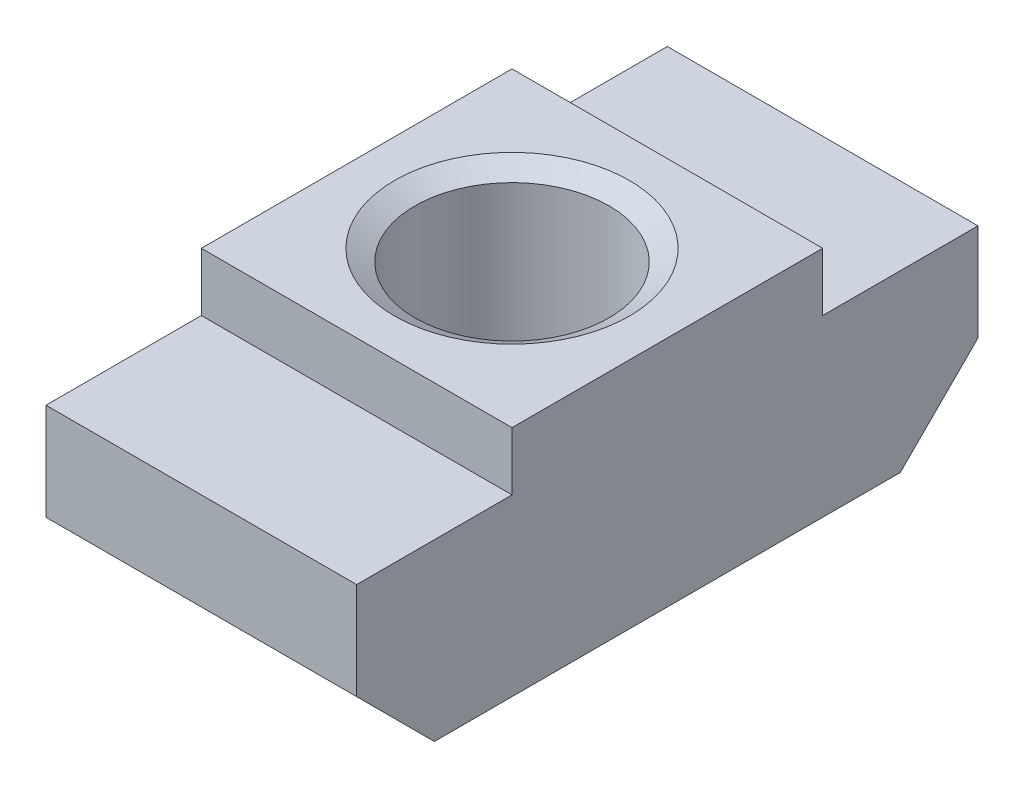
ISO-10303-21;
HEADER;
FILE_DESCRIPTION(('STEP AP214'),'2;1');
FILE_NAME('part.step','',(''),(''),'','','');
FILE_SCHEMA(('AUTOMOTIVE_DESIGN { 1 0 10303 214 1 1 1 1 }'));
ENDSEC;
DATA;
#1=APPLICATION_CONTEXT('core data for automotive mechanical design processes');
#2=APPLICATION_PROTOCOL_DEFINITION('international standard','automotive_design',2000,#1);
#3=PRODUCT_CONTEXT('',#1,'mechanical');
#4=PRODUCT('Part','Part','',(#3));
#5=PRODUCT_RELATED_PRODUCT_CATEGORY('part','',(#4));
#6=PRODUCT_DEFINITION_FORMATION('','',#4);
#7=PRODUCT_DEFINITION_CONTEXT('part definition',#1,'design');
#8=PRODUCT_DEFINITION('design','',#6,#7);
#9=PRODUCT_DEFINITION_SHAPE('','',#8);
#10=(LENGTH_UNIT() NAMED_UNIT(*) SI_UNIT(.MILLI.,.METRE.));
#11=(NAMED_UNIT(*) PLANE_ANGLE_UNIT() SI_UNIT($,.RADIAN.));
#12=(NAMED_UNIT(*) SI_UNIT($,.STERADIAN.) SOLID_ANGLE_UNIT());
#13=UNCERTAINTY_MEASURE_WITH_UNIT(LENGTH_MEASURE(1.E-05),#10,'distance_accuracy_value','');
#14=(GEOMETRIC_REPRESENTATION_CONTEXT(3) GLOBAL_UNCERTAINTY_ASSIGNED_CONTEXT((#13)) GLOBAL_UNIT_ASSIGNED_CONTEXT((#10,
#11,#12)) REPRESENTATION_CONTEXT('',''));
#15=CARTESIAN_POINT('',(0.,0.,0.));
#16=DIRECTION('',(0.,0.,1.));
#17=DIRECTION('',(1.,0.,0.));
#18=AXIS2_PLACEMENT_3D('',#15,#16,#17);
#19=CARTESIAN_POINT('',(4.,0.,16.));
#20=DIRECTION('',(-1.,0.,0.));
#21=DIRECTION('',(0.,0.,1.));
#22=AXIS2_PLACEMENT_3D('',#19,#20,#21);
#23=PLANE('',#22);
#24=DIRECTION('',(0.,0.,1.));
#25=VECTOR('',#24,1.);
#26=CARTESIAN_POINT('',(4.,4.5,16.));
#27=LINE('',#26,#25);
#28=CARTESIAN_POINT('',(4.,4.5,0.));
#29=VERTEX_POINT('',#28);
#30=CARTESIAN_POINT('',(4.,4.5,4.));
#31=VERTEX_POINT('',#30);
#32=EDGE_CURVE('E48',#29,#31,#27,.T.);
#33=ORIENTED_EDGE('',*,*,#32,.T.);
#34=DIRECTION('',(0.,1.,0.));
#35=VECTOR('',#34,1.);
#36=CARTESIAN_POINT('',(4.,0.,4.));
#37=LINE('',#36,#35);
#38=CARTESIAN_POINT('',(4.,6.,4.));
#39=VERTEX_POINT('',#38);
#40=EDGE_CURVE('E197',#31,#39,#37,.T.);
#41=ORIENTED_EDGE('',*,*,#40,.T.);
#42=DIRECTION('',(0.,0.,-1.));
#43=VECTOR('',#42,1.);
#44=CARTESIAN_POINT('',(4.,6.,16.));
#45=LINE('',#44,#43);
#46=CARTESIAN_POINT('',(4.,6.,12.));
#47=VERTEX_POINT('',#46);
#48=EDGE_CURVE('E144',#47,#39,#45,.T.);
#49=ORIENTED_EDGE('',*,*,#48,.F.);
#50=DIRECTION('',(0.,-1.,0.));
#51=VECTOR('',#50,1.);
#52=CARTESIAN_POINT('',(4.,0.,12.));
#53=LINE('',#52,#51);
#54=CARTESIAN_POINT('',(4.,4.5,12.));
#55=VERTEX_POINT('',#54);
#56=EDGE_CURVE('E184',#47,#55,#53,.T.);
#57=ORIENTED_EDGE('',*,*,#56,.T.);
#58=DIRECTION('',(0.,0.,1.));
#59=VECTOR('',#58,1.);
#60=CARTESIAN_POINT('',(4.,4.5,16.));
#61=LINE('',#60,#59);
#62=CARTESIAN_POINT('',(4.,4.5,16.));
#63=VERTEX_POINT('',#62);
#64=EDGE_CURVE('E187',#55,#63,#61,.T.);
#65=ORIENTED_EDGE('',*,*,#64,.T.);
#66=DIRECTION('',(0.,1.,0.));
#67=VECTOR('',#66,1.);
#68=CARTESIAN_POINT('',(4.,0.,16.));
#69=LINE('',#68,#67);
#70=CARTESIAN_POINT('',(4.,2.,16.));
#71=VERTEX_POINT('',#70);
#72=EDGE_CURVE('E128',#71,#63,#69,.T.);
#73=ORIENTED_EDGE('',*,*,#72,.F.);
#74=DIRECTION('',(0.,-0.707106781186548,-0.707106781186547));
#75=VECTOR('',#74,1.);
#76=CARTESIAN_POINT('',(4.,0.999999999999999,15.));
#77=LINE('',#76,#75);
#78=CARTESIAN_POINT('',(4.,0.,14.));
#79=VERTEX_POINT('',#78);
#80=EDGE_CURVE('E177',#71,#79,#77,.T.);
#81=ORIENTED_EDGE('',*,*,#80,.T.);
#82=DIRECTION('',(0.,0.,-1.));
#83=VECTOR('',#82,1.);
#84=CARTESIAN_POINT('',(4.,0.,16.));
#85=LINE('',#84,#83);
#86=CARTESIAN_POINT('',(4.,0.,2.));
#87=VERTEX_POINT('',#86);
#88=EDGE_CURVE('E138',#79,#87,#85,.T.);
#89=ORIENTED_EDGE('',*,*,#88,.T.);
#90=DIRECTION('',(0.,0.707106781186548,-0.707106781186547));
#91=VECTOR('',#90,1.);
#92=CARTESIAN_POINT('',(4.,-7.,9.));
#93=LINE('',#92,#91);
#94=CARTESIAN_POINT('',(4.,2.,0.));
#95=VERTEX_POINT('',#94);
#96=EDGE_CURVE('E169',#87,#95,#93,.T.);
#97=ORIENTED_EDGE('',*,*,#96,.T.);
#98=DIRECTION('',(0.,1.,0.));
#99=VECTOR('',#98,1.);
#100=CARTESIAN_POINT('',(4.,0.,0.));
#101=LINE('',#100,#99);
#102=EDGE_CURVE('E129',#95,#29,#101,.T.);
#103=ORIENTED_EDGE('',*,*,#102,.T.);
#104=EDGE_LOOP('',(#33,#41,#49,#57,#65,#73,#81,#89,#97,#103));
#105=FACE_BOUND('',#104,.T.);
#106=ADVANCED_FACE('F35',(#105),#23,.F.);
#107=CARTESIAN_POINT('',(-4.,6.,16.));
#108=DIRECTION('',(0.,-1.,0.));
#109=DIRECTION('',(0.,0.,-1.));
#110=AXIS2_PLACEMENT_3D('',#107,#108,#109);
#111=PLANE('',#110);
#112=CARTESIAN_POINT('',(0.,6.,8.));
#113=DIRECTION('',(0.,1.,0.));
#114=DIRECTION('',(0.,0.,1.));
#115=AXIS2_PLACEMENT_3D('',#112,#113,#114);
#116=CIRCLE('',#115,3.025);
#117=CARTESIAN_POINT('',(0.,6.,11.025));
#118=VERTEX_POINT('',#117);
#119=EDGE_CURVE('E166',#118,#118,#116,.T.);
#120=ORIENTED_EDGE('',*,*,#119,.F.);
#121=EDGE_LOOP('',(#120));
#122=FACE_BOUND('',#121,.T.);
#123=ORIENTED_EDGE('',*,*,#48,.T.);
#124=DIRECTION('',(-1.,0.,0.));
#125=VECTOR('',#124,1.);
#126=CARTESIAN_POINT('',(6.,6.,4.));
#127=LINE('',#126,#125);
#128=CARTESIAN_POINT('',(-4.,6.,4.));
#129=VERTEX_POINT('',#128);
#130=EDGE_CURVE('E201',#39,#129,#127,.T.);
#131=ORIENTED_EDGE('',*,*,#130,.T.);
#132=DIRECTION('',(0.,0.,-1.));
#133=VECTOR('',#132,1.);
#134=CARTESIAN_POINT('',(-4.,6.,16.));
#135=LINE('',#134,#133);
#136=CARTESIAN_POINT('',(-4.,6.,12.));
#137=VERTEX_POINT('',#136);
#138=EDGE_CURVE('E142',#137,#129,#135,.T.);
#139=ORIENTED_EDGE('',*,*,#138,.F.);
#140=DIRECTION('',(-1.,0.,0.));
#141=VECTOR('',#140,1.);
#142=CARTESIAN_POINT('',(6.,6.,12.));
#143=LINE('',#142,#141);
#144=EDGE_CURVE('E190',#47,#137,#143,.T.);
#145=ORIENTED_EDGE('',*,*,#144,.F.);
#146=EDGE_LOOP('',(#123,#131,#139,#145));
#147=FACE_BOUND('',#146,.T.);
#148=ADVANCED_FACE('F210',(#122,#147),#111,.F.);
#149=CARTESIAN_POINT('',(-4.,0.,16.));
#150=DIRECTION('',(1.,0.,0.));
#151=DIRECTION('',(0.,0.,-1.));
#152=AXIS2_PLACEMENT_3D('',#149,#150,#151);
#153=PLANE('',#152);
#154=ORIENTED_EDGE('',*,*,#138,.T.);
#155=DIRECTION('',(0.,1.,0.));
#156=VECTOR('',#155,1.);
#157=CARTESIAN_POINT('',(-4.,4.5,4.));
#158=LINE('',#157,#156);
#159=CARTESIAN_POINT('',(-4.,4.5,4.));
#160=VERTEX_POINT('',#159);
#161=EDGE_CURVE('E123',#160,#129,#158,.T.);
#162=ORIENTED_EDGE('',*,*,#161,.F.);
#163=DIRECTION('',(0.,0.,1.));
#164=VECTOR('',#163,1.);
#165=CARTESIAN_POINT('',(-4.,4.5,0.));
#166=LINE('',#165,#164);
#167=CARTESIAN_POINT('',(-4.,4.5,0.));
#168=VERTEX_POINT('',#167);
#169=EDGE_CURVE('E111',#168,#160,#166,.T.);
#170=ORIENTED_EDGE('',*,*,#169,.F.);
#171=DIRECTION('',(0.,-1.,0.));
#172=VECTOR('',#171,1.);
#173=CARTESIAN_POINT('',(-4.,0.,0.));
#174=LINE('',#173,#172);
#175=CARTESIAN_POINT('',(-4.,2.,0.));
#176=VERTEX_POINT('',#175);
#177=EDGE_CURVE('E121',#168,#176,#174,.T.);
#178=ORIENTED_EDGE('',*,*,#177,.T.);
#179=DIRECTION('',(0.,0.707106781186548,-0.707106781186547));
#180=VECTOR('',#179,1.);
#181=CARTESIAN_POINT('',(-4.,2.,0.));
#182=LINE('',#181,#180);
#183=CARTESIAN_POINT('',(-4.,0.,2.));
#184=VERTEX_POINT('',#183);
#185=EDGE_CURVE('E175',#184,#176,#182,.T.);
#186=ORIENTED_EDGE('',*,*,#185,.F.);
#187=DIRECTION('',(0.,0.,-1.));
#188=VECTOR('',#187,1.);
#189=CARTESIAN_POINT('',(-4.,0.,16.));
#190=LINE('',#189,#188);
#191=CARTESIAN_POINT('',(-4.,0.,14.));
#192=VERTEX_POINT('',#191);
#193=EDGE_CURVE('E140',#192,#184,#190,.T.);
#194=ORIENTED_EDGE('',*,*,#193,.F.);
#195=DIRECTION('',(0.,-0.707106781186548,-0.707106781186547));
#196=VECTOR('',#195,1.);
#197=CARTESIAN_POINT('',(-4.,2.,16.));
#198=LINE('',#197,#196);
#199=CARTESIAN_POINT('',(-4.,2.,16.));
#200=VERTEX_POINT('',#199);
#201=EDGE_CURVE('E159',#200,#192,#198,.T.);
#202=ORIENTED_EDGE('',*,*,#201,.F.);
#203=DIRECTION('',(0.,-1.,0.));
#204=VECTOR('',#203,1.);
#205=CARTESIAN_POINT('',(-4.,0.,16.));
#206=LINE('',#205,#204);
#207=CARTESIAN_POINT('',(-4.,4.5,16.));
#208=VERTEX_POINT('',#207);
#209=EDGE_CURVE('E132',#208,#200,#206,.T.);
#210=ORIENTED_EDGE('',*,*,#209,.F.);
#211=DIRECTION('',(0.,0.,1.));
#212=VECTOR('',#211,1.);
#213=CARTESIAN_POINT('',(-4.,4.5,16.));
#214=LINE('',#213,#212);
#215=CARTESIAN_POINT('',(-4.,4.5,12.));
#216=VERTEX_POINT('',#215);
#217=EDGE_CURVE('E56',#216,#208,#214,.T.);
#218=ORIENTED_EDGE('',*,*,#217,.F.);
#219=DIRECTION('',(0.,-1.,0.));
#220=VECTOR('',#219,1.);
#221=CARTESIAN_POINT('',(-4.,4.5,12.));
#222=LINE('',#221,#220);
#223=EDGE_CURVE('E194',#137,#216,#222,.T.);
#224=ORIENTED_EDGE('',*,*,#223,.F.);
#225=EDGE_LOOP('',(#154,#162,#170,#178,#186,#194,#202,#210,#218,#224));
#226=FACE_BOUND('',#225,.T.);
#227=ADVANCED_FACE('F119',(#226),#153,.F.);
#228=CARTESIAN_POINT('',(-4.,0.,16.));
#229=DIRECTION('',(0.,1.,0.));
#230=DIRECTION('',(0.,0.,1.));
#231=AXIS2_PLACEMENT_3D('',#228,#229,#230);
#232=PLANE('',#231);
#233=CARTESIAN_POINT('',(0.,0.,8.));
#234=DIRECTION('',(0.,1.,0.));
#235=DIRECTION('',(0.,0.,1.));
#236=AXIS2_PLACEMENT_3D('',#233,#234,#235);
#237=CIRCLE('',#236,2.5);
#238=CARTESIAN_POINT('',(0.,0.,10.5));
#239=VERTEX_POINT('',#238);
#240=EDGE_CURVE('E134',#239,#239,#237,.T.);
#241=ORIENTED_EDGE('',*,*,#240,.T.);
#242=EDGE_LOOP('',(#241));
#243=FACE_BOUND('',#242,.T.);
#244=ORIENTED_EDGE('',*,*,#88,.F.);
#245=DIRECTION('',(-1.,0.,0.));
#246=VECTOR('',#245,1.);
#247=CARTESIAN_POINT('',(6.,0.,14.));
#248=LINE('',#247,#246);
#249=EDGE_CURVE('E180',#79,#192,#248,.T.);
#250=ORIENTED_EDGE('',*,*,#249,.T.);
#251=ORIENTED_EDGE('',*,*,#193,.T.);
#252=DIRECTION('',(-1.,0.,0.));
#253=VECTOR('',#252,1.);
#254=CARTESIAN_POINT('',(6.,0.,2.));
#255=LINE('',#254,#253);
#256=EDGE_CURVE('E172',#87,#184,#255,.T.);
#257=ORIENTED_EDGE('',*,*,#256,.F.);
#258=EDGE_LOOP('',(#244,#250,#251,#257));
#259=FACE_BOUND('',#258,.T.);
#260=ADVANCED_FACE('F223',(#243,#259),#232,.F.);
#261=CARTESIAN_POINT('',(0.,0.,16.));
#262=DIRECTION('',(0.,0.,-1.));
#263=DIRECTION('',(-1.,0.,0.));
#264=AXIS2_PLACEMENT_3D('',#261,#262,#263);
#265=PLANE('',#264);
#266=ORIENTED_EDGE('',*,*,#72,.T.);
#267=DIRECTION('',(-1.,0.,0.));
#268=VECTOR('',#267,1.);
#269=CARTESIAN_POINT('',(0.,4.5,16.));
#270=LINE('',#269,#268);
#271=EDGE_CURVE('E42',#63,#208,#270,.T.);
#272=ORIENTED_EDGE('',*,*,#271,.T.);
#273=ORIENTED_EDGE('',*,*,#209,.T.);
#274=DIRECTION('',(1.,0.,0.));
#275=VECTOR('',#274,1.);
#276=CARTESIAN_POINT('',(0.,2.,16.));
#277=LINE('',#276,#275);
#278=EDGE_CURVE('E148',#200,#71,#277,.T.);
#279=ORIENTED_EDGE('',*,*,#278,.T.);
#280=EDGE_LOOP('',(#266,#272,#273,#279));
#281=FACE_BOUND('',#280,.T.);
#282=ADVANCED_FACE('F152',(#281),#265,.F.);
#283=CARTESIAN_POINT('',(0.,0.,0.));
#284=DIRECTION('',(0.,0.,-1.));
#285=DIRECTION('',(-1.,0.,0.));
#286=AXIS2_PLACEMENT_3D('',#283,#284,#285);
#287=PLANE('',#286);
#288=DIRECTION('',(-1.,0.,0.));
#289=VECTOR('',#288,1.);
#290=CARTESIAN_POINT('',(0.,4.5,0.));
#291=LINE('',#290,#289);
#292=EDGE_CURVE('E11',#29,#168,#291,.T.);
#293=ORIENTED_EDGE('',*,*,#292,.F.);
#294=ORIENTED_EDGE('',*,*,#102,.F.);
#295=DIRECTION('',(1.,0.,0.));
#296=VECTOR('',#295,1.);
#297=CARTESIAN_POINT('',(0.,2.,0.));
#298=LINE('',#297,#296);
#299=EDGE_CURVE('E127',#176,#95,#298,.T.);
#300=ORIENTED_EDGE('',*,*,#299,.F.);
#301=ORIENTED_EDGE('',*,*,#177,.F.);
#302=EDGE_LOOP('',(#293,#294,#300,#301));
#303=FACE_BOUND('',#302,.T.);
#304=ADVANCED_FACE('F126',(#303),#287,.T.);
#305=CARTESIAN_POINT('',(0.,6.,8.));
#306=DIRECTION('',(0.,1.,0.));
#307=DIRECTION('',(0.,0.,1.));
#308=AXIS2_PLACEMENT_3D('',#305,#306,#307);
#309=CYLINDRICAL_SURFACE('',#308,2.5);
#310=ORIENTED_EDGE('',*,*,#240,.F.);
#311=EDGE_LOOP('',(#310));
#312=FACE_BOUND('',#311,.T.);
#313=CARTESIAN_POINT('',(0.,5.69689110867544,8.));
#314=DIRECTION('',(0.,1.,0.));
#315=DIRECTION('',(0.,0.,1.));
#316=AXIS2_PLACEMENT_3D('',#313,#314,#315);
#317=CIRCLE('',#316,2.5);
#318=CARTESIAN_POINT('',(0.,5.69689110867544,10.5));
#319=VERTEX_POINT('',#318);
#320=EDGE_CURVE('E163',#319,#319,#317,.T.);
#321=ORIENTED_EDGE('',*,*,#320,.T.);
#322=EDGE_LOOP('',(#321));
#323=FACE_BOUND('',#322,.T.);
#324=ADVANCED_FACE('F252',(#312,#323),#309,.F.);
#325=CARTESIAN_POINT('',(0.,6.,8.));
#326=DIRECTION('',(0.,1.,0.));
#327=DIRECTION('',(0.,0.,1.));
#328=AXIS2_PLACEMENT_3D('',#325,#326,#327);
#329=CONICAL_SURFACE('',#328,3.025,1.0471975511966);
#330=ORIENTED_EDGE('',*,*,#320,.F.);
#331=EDGE_LOOP('',(#330));
#332=FACE_BOUND('',#331,.T.);
#333=ORIENTED_EDGE('',*,*,#119,.T.);
#334=EDGE_LOOP('',(#333));
#335=FACE_BOUND('',#334,.T.);
#336=ADVANCED_FACE('F257',(#332,#335),#329,.F.);
#337=CARTESIAN_POINT('',(6.,2.,0.));
#338=DIRECTION('',(0.,0.707106781186547,0.707106781186548));
#339=DIRECTION('',(0.,-0.707106781186548,0.707106781186547));
#340=AXIS2_PLACEMENT_3D('',#337,#338,#339);
#341=PLANE('',#340);
#342=ORIENTED_EDGE('',*,*,#256,.T.);
#343=ORIENTED_EDGE('',*,*,#185,.T.);
#344=ORIENTED_EDGE('',*,*,#299,.T.);
#345=ORIENTED_EDGE('',*,*,#96,.F.);
#346=EDGE_LOOP('',(#342,#343,#344,#345));
#347=FACE_BOUND('',#346,.T.);
#348=ADVANCED_FACE('F221',(#347),#341,.F.);
#349=CARTESIAN_POINT('',(6.,2.,16.));
#350=DIRECTION('',(0.,0.707106781186547,-0.707106781186548));
#351=DIRECTION('',(0.,0.707106781186548,0.707106781186547));
#352=AXIS2_PLACEMENT_3D('',#349,#350,#351);
#353=PLANE('',#352);
#354=ORIENTED_EDGE('',*,*,#278,.F.);
#355=ORIENTED_EDGE('',*,*,#201,.T.);
#356=ORIENTED_EDGE('',*,*,#249,.F.);
#357=ORIENTED_EDGE('',*,*,#80,.F.);
#358=EDGE_LOOP('',(#354,#355,#356,#357));
#359=FACE_BOUND('',#358,.T.);
#360=ADVANCED_FACE('F225',(#359),#353,.F.);
#361=CARTESIAN_POINT('',(6.,4.5,12.));
#362=DIRECTION('',(0.,0.,-1.));
#363=DIRECTION('',(-1.,0.,0.));
#364=AXIS2_PLACEMENT_3D('',#361,#362,#363);
#365=PLANE('',#364);
#366=ORIENTED_EDGE('',*,*,#144,.T.);
#367=ORIENTED_EDGE('',*,*,#223,.T.);
#368=DIRECTION('',(-1.,0.,0.));
#369=VECTOR('',#368,1.);
#370=CARTESIAN_POINT('',(6.,4.5,12.));
#371=LINE('',#370,#369);
#372=EDGE_CURVE('E189',#55,#216,#371,.T.);
#373=ORIENTED_EDGE('',*,*,#372,.F.);
#374=ORIENTED_EDGE('',*,*,#56,.F.);
#375=EDGE_LOOP('',(#366,#367,#373,#374));
#376=FACE_BOUND('',#375,.T.);
#377=ADVANCED_FACE('F215',(#376),#365,.F.);
#378=CARTESIAN_POINT('',(6.,4.5,16.));
#379=DIRECTION('',(0.,-1.,0.));
#380=DIRECTION('',(0.,0.,-1.));
#381=AXIS2_PLACEMENT_3D('',#378,#379,#380);
#382=PLANE('',#381);
#383=ORIENTED_EDGE('',*,*,#372,.T.);
#384=ORIENTED_EDGE('',*,*,#217,.T.);
#385=ORIENTED_EDGE('',*,*,#271,.F.);
#386=ORIENTED_EDGE('',*,*,#64,.F.);
#387=EDGE_LOOP('',(#383,#384,#385,#386));
#388=FACE_BOUND('',#387,.T.);
#389=ADVANCED_FACE('F226',(#388),#382,.F.);
#390=CARTESIAN_POINT('',(6.,4.5,4.));
#391=DIRECTION('',(0.,0.,1.));
#392=DIRECTION('',(1.,0.,0.));
#393=AXIS2_PLACEMENT_3D('',#390,#391,#392);
#394=PLANE('',#393);
#395=DIRECTION('',(-1.,0.,0.));
#396=VECTOR('',#395,1.);
#397=CARTESIAN_POINT('',(6.,4.5,4.));
#398=LINE('',#397,#396);
#399=EDGE_CURVE('E202',#31,#160,#398,.T.);
#400=ORIENTED_EDGE('',*,*,#399,.T.);
#401=ORIENTED_EDGE('',*,*,#161,.T.);
#402=ORIENTED_EDGE('',*,*,#130,.F.);
#403=ORIENTED_EDGE('',*,*,#40,.F.);
#404=EDGE_LOOP('',(#400,#401,#402,#403));
#405=FACE_BOUND('',#404,.T.);
#406=ADVANCED_FACE('F207',(#405),#394,.F.);
#407=CARTESIAN_POINT('',(6.,4.5,0.));
#408=DIRECTION('',(0.,-1.,0.));
#409=DIRECTION('',(0.,0.,-1.));
#410=AXIS2_PLACEMENT_3D('',#407,#408,#409);
#411=PLANE('',#410);
#412=ORIENTED_EDGE('',*,*,#292,.T.);
#413=ORIENTED_EDGE('',*,*,#169,.T.);
#414=ORIENTED_EDGE('',*,*,#399,.F.);
#415=ORIENTED_EDGE('',*,*,#32,.F.);
#416=EDGE_LOOP('',(#412,#413,#414,#415));
#417=FACE_BOUND('',#416,.T.);
#418=ADVANCED_FACE('F110',(#417),#411,.F.);
#419=CLOSED_SHELL('',(#106,#148,#227,#260,#282,#304,#324,#336,#348,#360,#377,#389,#406,#418));
#420=MANIFOLD_SOLID_BREP('B2',#419);
#421=ADVANCED_BREP_SHAPE_REPRESENTATION('',(#18,#420),#14);
#422=SHAPE_DEFINITION_REPRESENTATION(#9,#421);
ENDSEC;
END-ISO-10303-21;
